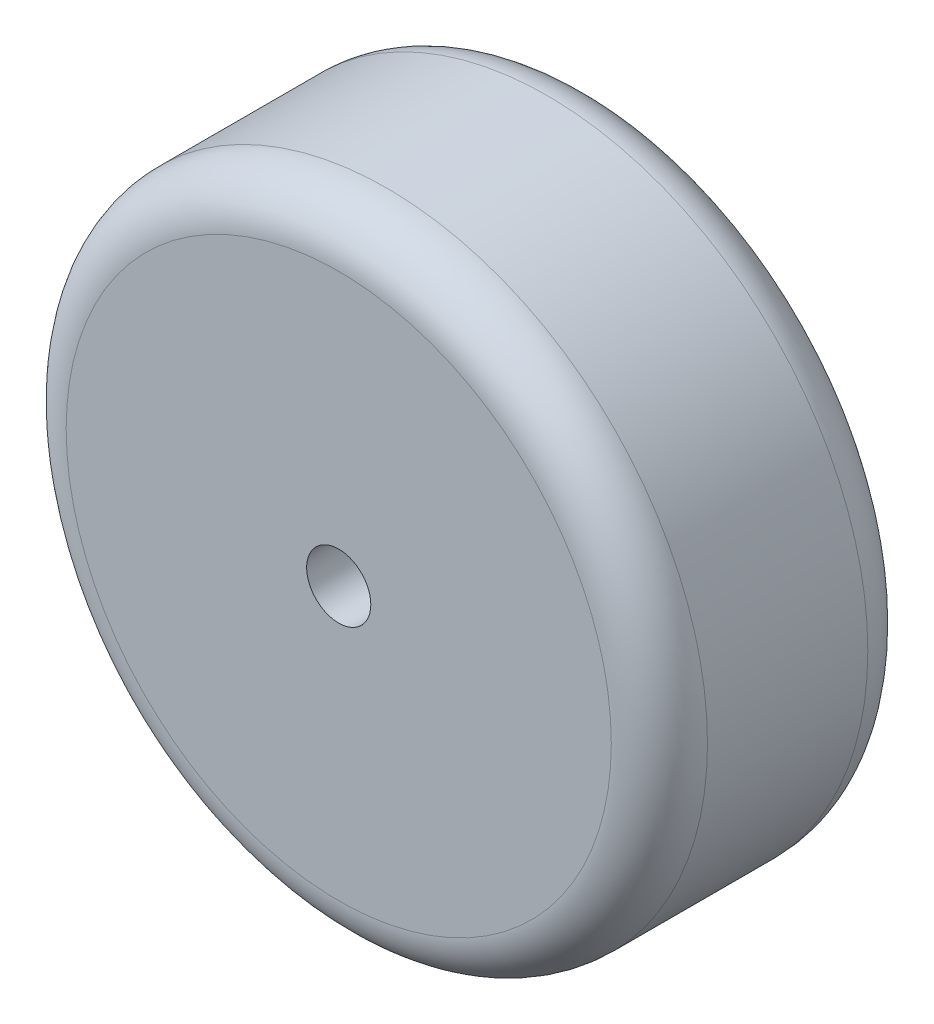
ISO-10303-21;
HEADER;
FILE_DESCRIPTION(('STEP AP214'),'2;1');
FILE_NAME('part.step','',(''),(''),'','','');
FILE_SCHEMA(('AUTOMOTIVE_DESIGN { 1 0 10303 214 1 1 1 1 }'));
ENDSEC;
DATA;
#1=APPLICATION_CONTEXT('core data for automotive mechanical design processes');
#2=APPLICATION_PROTOCOL_DEFINITION('international standard','automotive_design',2000,#1);
#3=PRODUCT_CONTEXT('',#1,'mechanical');
#4=PRODUCT('Part','Part','',(#3));
#5=PRODUCT_RELATED_PRODUCT_CATEGORY('part','',(#4));
#6=PRODUCT_DEFINITION_FORMATION('','',#4);
#7=PRODUCT_DEFINITION_CONTEXT('part definition',#1,'design');
#8=PRODUCT_DEFINITION('design','',#6,#7);
#9=PRODUCT_DEFINITION_SHAPE('','',#8);
#10=(LENGTH_UNIT() NAMED_UNIT(*) SI_UNIT(.MILLI.,.METRE.));
#11=(NAMED_UNIT(*) PLANE_ANGLE_UNIT() SI_UNIT($,.RADIAN.));
#12=(NAMED_UNIT(*) SI_UNIT($,.STERADIAN.) SOLID_ANGLE_UNIT());
#13=UNCERTAINTY_MEASURE_WITH_UNIT(LENGTH_MEASURE(1.E-05),#10,'distance_accuracy_value','');
#14=(GEOMETRIC_REPRESENTATION_CONTEXT(3) GLOBAL_UNCERTAINTY_ASSIGNED_CONTEXT((#13)) GLOBAL_UNIT_ASSIGNED_CONTEXT((#10,
#11,#12)) REPRESENTATION_CONTEXT('',''));
#15=CARTESIAN_POINT('',(0.,0.,0.));
#16=DIRECTION('',(0.,0.,1.));
#17=DIRECTION('',(1.,0.,0.));
#18=AXIS2_PLACEMENT_3D('',#15,#16,#17);
#19=CARTESIAN_POINT('',(0.,0.,8.));
#20=DIRECTION('',(0.,0.,-1.));
#21=DIRECTION('',(-1.,0.,0.));
#22=AXIS2_PLACEMENT_3D('',#19,#20,#21);
#23=CYLINDRICAL_SURFACE('',#22,10.);
#24=CARTESIAN_POINT('',(0.,0.,1.5));
#25=DIRECTION('',(0.,0.,1.));
#26=DIRECTION('',(1.,0.,0.));
#27=AXIS2_PLACEMENT_3D('',#24,#25,#26);
#28=CIRCLE('',#27,10.);
#29=CARTESIAN_POINT('',(10.,0.,1.5));
#30=VERTEX_POINT('',#29);
#31=EDGE_CURVE('E43',#30,#30,#28,.T.);
#32=ORIENTED_EDGE('',*,*,#31,.T.);
#33=EDGE_LOOP('',(#32));
#34=FACE_BOUND('',#33,.T.);
#35=CARTESIAN_POINT('',(0.,0.,6.5));
#36=DIRECTION('',(0.,0.,1.));
#37=DIRECTION('',(1.,0.,0.));
#38=AXIS2_PLACEMENT_3D('',#35,#36,#37);
#39=CIRCLE('',#38,10.);
#40=CARTESIAN_POINT('',(10.,0.,6.5));
#41=VERTEX_POINT('',#40);
#42=EDGE_CURVE('E47',#41,#41,#39,.F.);
#43=ORIENTED_EDGE('',*,*,#42,.T.);
#44=EDGE_LOOP('',(#43));
#45=FACE_BOUND('',#44,.T.);
#46=ADVANCED_FACE('F32',(#34,#45),#23,.T.);
#47=CARTESIAN_POINT('',(0.,0.,8.));
#48=DIRECTION('',(0.,0.,1.));
#49=DIRECTION('',(1.,0.,0.));
#50=AXIS2_PLACEMENT_3D('',#47,#48,#49);
#51=PLANE('',#50);
#52=CARTESIAN_POINT('',(0.,0.,8.));
#53=DIRECTION('',(0.,0.,1.));
#54=DIRECTION('',(1.,0.,0.));
#55=AXIS2_PLACEMENT_3D('',#52,#53,#54);
#56=CIRCLE('',#55,1.);
#57=CARTESIAN_POINT('',(1.,0.,8.));
#58=VERTEX_POINT('',#57);
#59=EDGE_CURVE('E53',#58,#58,#56,.T.);
#60=ORIENTED_EDGE('',*,*,#59,.F.);
#61=EDGE_LOOP('',(#60));
#62=FACE_BOUND('',#61,.T.);
#63=CARTESIAN_POINT('',(0.,0.,8.));
#64=DIRECTION('',(0.,0.,1.));
#65=DIRECTION('',(1.,0.,0.));
#66=AXIS2_PLACEMENT_3D('',#63,#64,#65);
#67=CIRCLE('',#66,8.5);
#68=CARTESIAN_POINT('',(8.5,0.,8.));
#69=VERTEX_POINT('',#68);
#70=EDGE_CURVE('E10',#69,#69,#67,.T.);
#71=ORIENTED_EDGE('',*,*,#70,.T.);
#72=EDGE_LOOP('',(#71));
#73=FACE_BOUND('',#72,.T.);
#74=ADVANCED_FACE('F67',(#62,#73),#51,.T.);
#75=CARTESIAN_POINT('',(0.,0.,0.));
#76=DIRECTION('',(0.,0.,1.));
#77=DIRECTION('',(1.,0.,0.));
#78=AXIS2_PLACEMENT_3D('',#75,#76,#77);
#79=PLANE('',#78);
#80=CARTESIAN_POINT('',(0.,0.,0.));
#81=DIRECTION('',(0.,0.,1.));
#82=DIRECTION('',(1.,0.,0.));
#83=AXIS2_PLACEMENT_3D('',#80,#81,#82);
#84=CIRCLE('',#83,1.);
#85=CARTESIAN_POINT('',(1.,0.,0.));
#86=VERTEX_POINT('',#85);
#87=EDGE_CURVE('E52',#86,#86,#84,.T.);
#88=ORIENTED_EDGE('',*,*,#87,.T.);
#89=EDGE_LOOP('',(#88));
#90=FACE_BOUND('',#89,.T.);
#91=CARTESIAN_POINT('',(0.,0.,0.));
#92=DIRECTION('',(0.,0.,1.));
#93=DIRECTION('',(1.,0.,0.));
#94=AXIS2_PLACEMENT_3D('',#91,#92,#93);
#95=CIRCLE('',#94,8.5);
#96=CARTESIAN_POINT('',(8.5,0.,0.));
#97=VERTEX_POINT('',#96);
#98=EDGE_CURVE('E39',#97,#97,#95,.F.);
#99=ORIENTED_EDGE('',*,*,#98,.T.);
#100=EDGE_LOOP('',(#99));
#101=FACE_BOUND('',#100,.T.);
#102=ADVANCED_FACE('F59',(#90,#101),#79,.F.);
#103=CARTESIAN_POINT('',(0.,0.,1.5));
#104=DIRECTION('',(0.,0.,1.));
#105=DIRECTION('',(1.,0.,0.));
#106=AXIS2_PLACEMENT_3D('',#103,#104,#105);
#107=TOROIDAL_SURFACE('',#106,8.5,1.5);
#108=ORIENTED_EDGE('',*,*,#98,.F.);
#109=EDGE_LOOP('',(#108));
#110=FACE_BOUND('',#109,.T.);
#111=ORIENTED_EDGE('',*,*,#31,.F.);
#112=EDGE_LOOP('',(#111));
#113=FACE_BOUND('',#112,.T.);
#114=ADVANCED_FACE('F74',(#110,#113),#107,.T.);
#115=CARTESIAN_POINT('',(0.,0.,6.5));
#116=DIRECTION('',(0.,0.,1.));
#117=DIRECTION('',(1.,0.,0.));
#118=AXIS2_PLACEMENT_3D('',#115,#116,#117);
#119=TOROIDAL_SURFACE('',#118,8.5,1.5);
#120=ORIENTED_EDGE('',*,*,#42,.F.);
#121=EDGE_LOOP('',(#120));
#122=FACE_BOUND('',#121,.T.);
#123=ORIENTED_EDGE('',*,*,#70,.F.);
#124=EDGE_LOOP('',(#123));
#125=FACE_BOUND('',#124,.T.);
#126=ADVANCED_FACE('F34',(#122,#125),#119,.T.);
#127=CARTESIAN_POINT('',(0.,0.,0.));
#128=DIRECTION('',(0.,0.,1.));
#129=DIRECTION('',(1.,0.,0.));
#130=AXIS2_PLACEMENT_3D('',#127,#128,#129);
#131=CYLINDRICAL_SURFACE('',#130,1.);
#132=ORIENTED_EDGE('',*,*,#87,.F.);
#133=EDGE_LOOP('',(#132));
#134=FACE_BOUND('',#133,.T.);
#135=ORIENTED_EDGE('',*,*,#59,.T.);
#136=EDGE_LOOP('',(#135));
#137=FACE_BOUND('',#136,.T.);
#138=ADVANCED_FACE('F61',(#134,#137),#131,.F.);
#139=CLOSED_SHELL('',(#46,#74,#102,#114,#126,#138));
#140=MANIFOLD_SOLID_BREP('B2',#139);
#141=ADVANCED_BREP_SHAPE_REPRESENTATION('',(#18,#140),#14);
#142=SHAPE_DEFINITION_REPRESENTATION(#9,#141);
ENDSEC;
END-ISO-10303-21;
